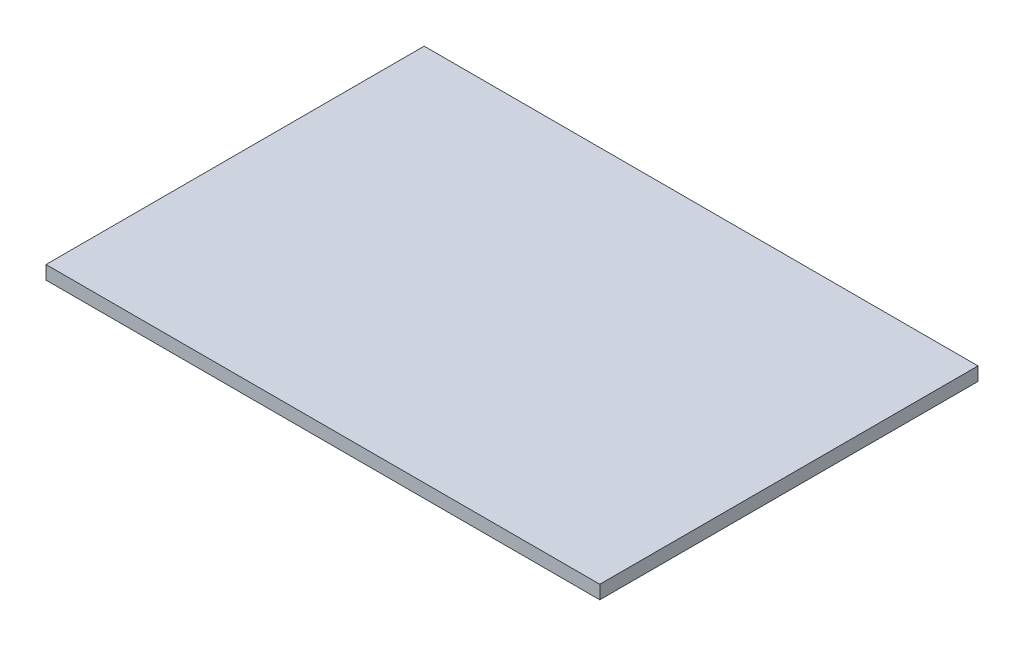
ISO-10303-21;
HEADER;
FILE_DESCRIPTION(('STEP AP214'),'2;1');
FILE_NAME('part.step','',(''),(''),'','','');
FILE_SCHEMA(('AUTOMOTIVE_DESIGN { 1 0 10303 214 1 1 1 1 }'));
ENDSEC;
DATA;
#1=APPLICATION_CONTEXT('core data for automotive mechanical design processes');
#2=APPLICATION_PROTOCOL_DEFINITION('international standard','automotive_design',2000,#1);
#3=PRODUCT_CONTEXT('',#1,'mechanical');
#4=PRODUCT('Part','Part','',(#3));
#5=PRODUCT_RELATED_PRODUCT_CATEGORY('part','',(#4));
#6=PRODUCT_DEFINITION_FORMATION('','',#4);
#7=PRODUCT_DEFINITION_CONTEXT('part definition',#1,'design');
#8=PRODUCT_DEFINITION('design','',#6,#7);
#9=PRODUCT_DEFINITION_SHAPE('','',#8);
#10=(LENGTH_UNIT() NAMED_UNIT(*) SI_UNIT(.MILLI.,.METRE.));
#11=(NAMED_UNIT(*) PLANE_ANGLE_UNIT() SI_UNIT($,.RADIAN.));
#12=(NAMED_UNIT(*) SI_UNIT($,.STERADIAN.) SOLID_ANGLE_UNIT());
#13=UNCERTAINTY_MEASURE_WITH_UNIT(LENGTH_MEASURE(1.E-05),#10,'distance_accuracy_value','');
#14=(GEOMETRIC_REPRESENTATION_CONTEXT(3) GLOBAL_UNCERTAINTY_ASSIGNED_CONTEXT((#13)) GLOBAL_UNIT_ASSIGNED_CONTEXT((#10,
#11,#12)) REPRESENTATION_CONTEXT('',''));
#15=CARTESIAN_POINT('',(0.,0.,0.));
#16=DIRECTION('',(0.,0.,1.));
#17=DIRECTION('',(1.,0.,0.));
#18=AXIS2_PLACEMENT_3D('',#15,#16,#17);
#19=CARTESIAN_POINT('',(0.,1.,0.));
#20=DIRECTION('',(1.,0.,0.));
#21=DIRECTION('',(0.,0.,-1.));
#22=AXIS2_PLACEMENT_3D('',#19,#20,#21);
#23=PLANE('',#22);
#24=DIRECTION('',(0.,0.,1.));
#25=VECTOR('',#24,1.);
#26=CARTESIAN_POINT('',(0.,0.,0.));
#27=LINE('',#26,#25);
#28=CARTESIAN_POINT('',(0.,0.,-28.));
#29=VERTEX_POINT('',#28);
#30=CARTESIAN_POINT('',(0.,0.,0.));
#31=VERTEX_POINT('',#30);
#32=EDGE_CURVE('E99',#29,#31,#27,.T.);
#33=ORIENTED_EDGE('',*,*,#32,.T.);
#34=DIRECTION('',(0.,-1.,0.));
#35=VECTOR('',#34,1.);
#36=CARTESIAN_POINT('',(0.,1.,0.));
#37=LINE('',#36,#35);
#38=CARTESIAN_POINT('',(0.,1.,0.));
#39=VERTEX_POINT('',#38);
#40=EDGE_CURVE('E11',#39,#31,#37,.T.);
#41=ORIENTED_EDGE('',*,*,#40,.F.);
#42=DIRECTION('',(0.,0.,1.));
#43=VECTOR('',#42,1.);
#44=CARTESIAN_POINT('',(0.,1.,0.));
#45=LINE('',#44,#43);
#46=CARTESIAN_POINT('',(0.,1.,-28.));
#47=VERTEX_POINT('',#46);
#48=EDGE_CURVE('E87',#47,#39,#45,.T.);
#49=ORIENTED_EDGE('',*,*,#48,.F.);
#50=DIRECTION('',(0.,-1.,0.));
#51=VECTOR('',#50,1.);
#52=CARTESIAN_POINT('',(0.,1.,-28.));
#53=LINE('',#52,#51);
#54=EDGE_CURVE('E95',#47,#29,#53,.T.);
#55=ORIENTED_EDGE('',*,*,#54,.T.);
#56=EDGE_LOOP('',(#33,#41,#49,#55));
#57=FACE_BOUND('',#56,.T.);
#58=ADVANCED_FACE('F36',(#57),#23,.F.);
#59=CARTESIAN_POINT('',(0.,1.,0.));
#60=DIRECTION('',(0.,0.,-1.));
#61=DIRECTION('',(-1.,0.,0.));
#62=AXIS2_PLACEMENT_3D('',#59,#60,#61);
#63=PLANE('',#62);
#64=DIRECTION('',(1.,0.,0.));
#65=VECTOR('',#64,1.);
#66=CARTESIAN_POINT('',(0.,0.,0.));
#67=LINE('',#66,#65);
#68=CARTESIAN_POINT('',(41.,0.,0.));
#69=VERTEX_POINT('',#68);
#70=EDGE_CURVE('E91',#31,#69,#67,.T.);
#71=ORIENTED_EDGE('',*,*,#70,.T.);
#72=DIRECTION('',(0.,-1.,0.));
#73=VECTOR('',#72,1.);
#74=CARTESIAN_POINT('',(41.,1.,0.));
#75=LINE('',#74,#73);
#76=CARTESIAN_POINT('',(41.,1.,0.));
#77=VERTEX_POINT('',#76);
#78=EDGE_CURVE('E44',#77,#69,#75,.T.);
#79=ORIENTED_EDGE('',*,*,#78,.F.);
#80=DIRECTION('',(1.,0.,0.));
#81=VECTOR('',#80,1.);
#82=CARTESIAN_POINT('',(0.,1.,0.));
#83=LINE('',#82,#81);
#84=EDGE_CURVE('E82',#39,#77,#83,.T.);
#85=ORIENTED_EDGE('',*,*,#84,.F.);
#86=ORIENTED_EDGE('',*,*,#40,.T.);
#87=EDGE_LOOP('',(#71,#79,#85,#86));
#88=FACE_BOUND('',#87,.T.);
#89=ADVANCED_FACE('F90',(#88),#63,.F.);
#90=CARTESIAN_POINT('',(41.,1.,0.));
#91=DIRECTION('',(-1.,0.,0.));
#92=DIRECTION('',(0.,0.,1.));
#93=AXIS2_PLACEMENT_3D('',#90,#91,#92);
#94=PLANE('',#93);
#95=DIRECTION('',(0.,0.,-1.));
#96=VECTOR('',#95,1.);
#97=CARTESIAN_POINT('',(41.,0.,0.));
#98=LINE('',#97,#96);
#99=CARTESIAN_POINT('',(41.,0.,-28.));
#100=VERTEX_POINT('',#99);
#101=EDGE_CURVE('E69',#69,#100,#98,.T.);
#102=ORIENTED_EDGE('',*,*,#101,.T.);
#103=DIRECTION('',(0.,-1.,0.));
#104=VECTOR('',#103,1.);
#105=CARTESIAN_POINT('',(41.,1.,-28.));
#106=LINE('',#105,#104);
#107=CARTESIAN_POINT('',(41.,1.,-28.));
#108=VERTEX_POINT('',#107);
#109=EDGE_CURVE('E92',#108,#100,#106,.T.);
#110=ORIENTED_EDGE('',*,*,#109,.F.);
#111=DIRECTION('',(0.,0.,-1.));
#112=VECTOR('',#111,1.);
#113=CARTESIAN_POINT('',(41.,1.,0.));
#114=LINE('',#113,#112);
#115=EDGE_CURVE('E85',#77,#108,#114,.T.);
#116=ORIENTED_EDGE('',*,*,#115,.F.);
#117=ORIENTED_EDGE('',*,*,#78,.T.);
#118=EDGE_LOOP('',(#102,#110,#116,#117));
#119=FACE_BOUND('',#118,.T.);
#120=ADVANCED_FACE('F93',(#119),#94,.F.);
#121=CARTESIAN_POINT('',(0.,1.,-28.));
#122=DIRECTION('',(0.,0.,1.));
#123=DIRECTION('',(1.,0.,0.));
#124=AXIS2_PLACEMENT_3D('',#121,#122,#123);
#125=PLANE('',#124);
#126=DIRECTION('',(-1.,0.,0.));
#127=VECTOR('',#126,1.);
#128=CARTESIAN_POINT('',(0.,0.,-28.));
#129=LINE('',#128,#127);
#130=EDGE_CURVE('E75',#100,#29,#129,.T.);
#131=ORIENTED_EDGE('',*,*,#130,.T.);
#132=ORIENTED_EDGE('',*,*,#54,.F.);
#133=DIRECTION('',(-1.,0.,0.));
#134=VECTOR('',#133,1.);
#135=CARTESIAN_POINT('',(0.,1.,-28.));
#136=LINE('',#135,#134);
#137=EDGE_CURVE('E52',#108,#47,#136,.T.);
#138=ORIENTED_EDGE('',*,*,#137,.F.);
#139=ORIENTED_EDGE('',*,*,#109,.T.);
#140=EDGE_LOOP('',(#131,#132,#138,#139));
#141=FACE_BOUND('',#140,.T.);
#142=ADVANCED_FACE('F106',(#141),#125,.F.);
#143=CARTESIAN_POINT('',(0.,1.,0.));
#144=DIRECTION('',(0.,-1.,0.));
#145=DIRECTION('',(0.,0.,-1.));
#146=AXIS2_PLACEMENT_3D('',#143,#144,#145);
#147=PLANE('',#146);
#148=ORIENTED_EDGE('',*,*,#48,.T.);
#149=ORIENTED_EDGE('',*,*,#84,.T.);
#150=ORIENTED_EDGE('',*,*,#115,.T.);
#151=ORIENTED_EDGE('',*,*,#137,.T.);
#152=EDGE_LOOP('',(#148,#149,#150,#151));
#153=FACE_BOUND('',#152,.T.);
#154=ADVANCED_FACE('F83',(#153),#147,.F.);
#155=CARTESIAN_POINT('',(0.,0.,0.));
#156=DIRECTION('',(0.,-1.,0.));
#157=DIRECTION('',(0.,0.,-1.));
#158=AXIS2_PLACEMENT_3D('',#155,#156,#157);
#159=PLANE('',#158);
#160=ORIENTED_EDGE('',*,*,#32,.F.);
#161=ORIENTED_EDGE('',*,*,#130,.F.);
#162=ORIENTED_EDGE('',*,*,#101,.F.);
#163=ORIENTED_EDGE('',*,*,#70,.F.);
#164=EDGE_LOOP('',(#160,#161,#162,#163));
#165=FACE_BOUND('',#164,.T.);
#166=ADVANCED_FACE('F109',(#165),#159,.T.);
#167=CLOSED_SHELL('',(#58,#89,#120,#142,#154,#166));
#168=MANIFOLD_SOLID_BREP('B2',#167);
#169=ADVANCED_BREP_SHAPE_REPRESENTATION('',(#18,#168),#14);
#170=SHAPE_DEFINITION_REPRESENTATION(#9,#169);
ENDSEC;
END-ISO-10303-21;
